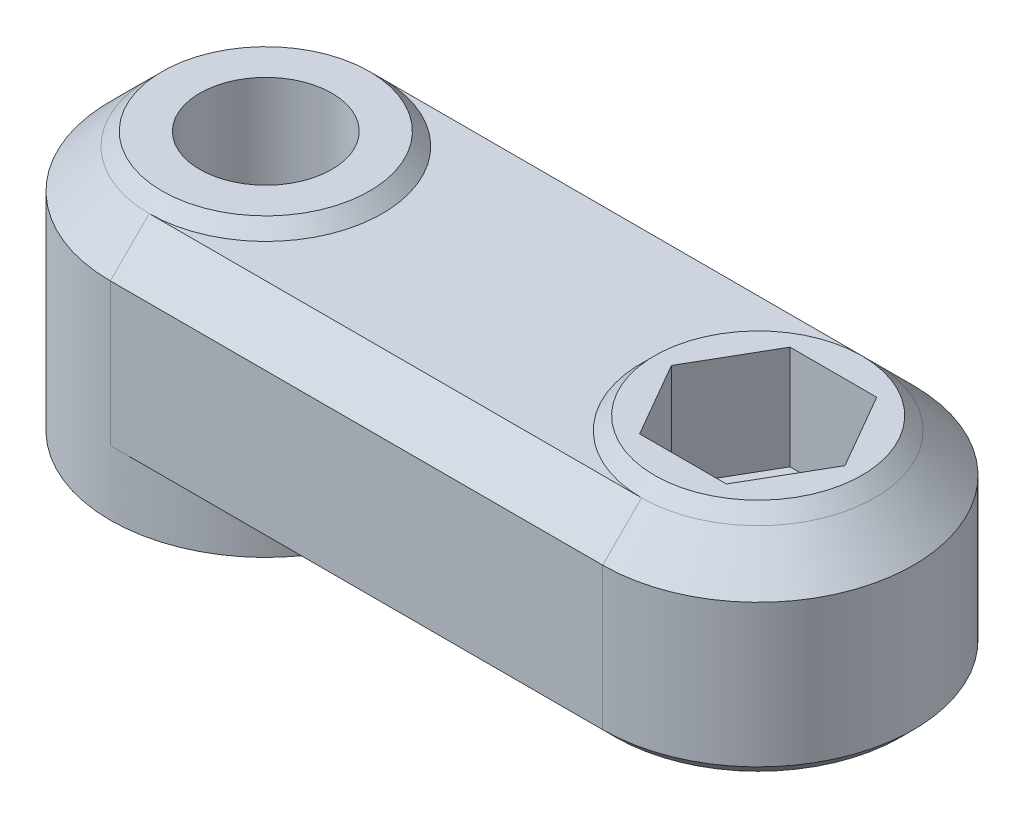
ISO-10303-21;
HEADER;
FILE_DESCRIPTION(('STEP AP214'),'2;1');
FILE_NAME('part.step','',(''),(''),'','','');
FILE_SCHEMA(('AUTOMOTIVE_DESIGN { 1 0 10303 214 1 1 1 1 }'));
ENDSEC;
DATA;
#1=APPLICATION_CONTEXT('core data for automotive mechanical design processes');
#2=APPLICATION_PROTOCOL_DEFINITION('international standard','automotive_design',2000,#1);
#3=PRODUCT_CONTEXT('',#1,'mechanical');
#4=PRODUCT('Part','Part','',(#3));
#5=PRODUCT_RELATED_PRODUCT_CATEGORY('part','',(#4));
#6=PRODUCT_DEFINITION_FORMATION('','',#4);
#7=PRODUCT_DEFINITION_CONTEXT('part definition',#1,'design');
#8=PRODUCT_DEFINITION('design','',#6,#7);
#9=PRODUCT_DEFINITION_SHAPE('','',#8);
#10=(LENGTH_UNIT() NAMED_UNIT(*) SI_UNIT(.MILLI.,.METRE.));
#11=(NAMED_UNIT(*) PLANE_ANGLE_UNIT() SI_UNIT($,.RADIAN.));
#12=(NAMED_UNIT(*) SI_UNIT($,.STERADIAN.) SOLID_ANGLE_UNIT());
#13=UNCERTAINTY_MEASURE_WITH_UNIT(LENGTH_MEASURE(1.E-05),#10,'distance_accuracy_value','');
#14=(GEOMETRIC_REPRESENTATION_CONTEXT(3) GLOBAL_UNCERTAINTY_ASSIGNED_CONTEXT((#13)) GLOBAL_UNIT_ASSIGNED_CONTEXT((#10,
#11,#12)) REPRESENTATION_CONTEXT('',''));
#15=CARTESIAN_POINT('',(0.,0.,0.));
#16=DIRECTION('',(0.,0.,1.));
#17=DIRECTION('',(1.,0.,0.));
#18=AXIS2_PLACEMENT_3D('',#15,#16,#17);
#19=CARTESIAN_POINT('',(0.,10.,0.));
#20=DIRECTION('',(0.,1.,0.));
#21=DIRECTION('',(0.,0.,1.));
#22=AXIS2_PLACEMENT_3D('',#19,#20,#21);
#23=PLANE('',#22);
#24=DIRECTION('',(1.,0.,0.));
#25=VECTOR('',#24,1.);
#26=CARTESIAN_POINT('',(17.3256842193501,10.,2.89999999999999));
#27=LINE('',#26,#25);
#28=CARTESIAN_POINT('',(17.3256842193501,10.,2.89999999999999));
#29=VERTEX_POINT('',#28);
#30=CARTESIAN_POINT('',(20.6743157806499,10.,2.89999999999999));
#31=VERTEX_POINT('',#30);
#32=EDGE_CURVE('E205',#29,#31,#27,.T.);
#33=ORIENTED_EDGE('',*,*,#32,.F.);
#34=DIRECTION('',(0.5,0.,0.866025403784439));
#35=VECTOR('',#34,1.);
#36=CARTESIAN_POINT('',(15.6513684387002,10.,0.));
#37=LINE('',#36,#35);
#38=CARTESIAN_POINT('',(15.6513684387002,10.,0.));
#39=VERTEX_POINT('',#38);
#40=EDGE_CURVE('E332',#39,#29,#37,.T.);
#41=ORIENTED_EDGE('',*,*,#40,.F.);
#42=DIRECTION('',(-0.5,0.,0.866025403784439));
#43=VECTOR('',#42,1.);
#44=CARTESIAN_POINT('',(17.3256842193501,10.,-2.9));
#45=LINE('',#44,#43);
#46=CARTESIAN_POINT('',(17.3256842193501,10.,-2.9));
#47=VERTEX_POINT('',#46);
#48=EDGE_CURVE('E336',#47,#39,#45,.T.);
#49=ORIENTED_EDGE('',*,*,#48,.F.);
#50=DIRECTION('',(-1.,0.,0.));
#51=VECTOR('',#50,1.);
#52=CARTESIAN_POINT('',(20.6743157806499,10.,-2.9));
#53=LINE('',#52,#51);
#54=CARTESIAN_POINT('',(20.6743157806499,10.,-2.9));
#55=VERTEX_POINT('',#54);
#56=EDGE_CURVE('E339',#55,#47,#53,.T.);
#57=ORIENTED_EDGE('',*,*,#56,.F.);
#58=DIRECTION('',(-0.5,0.,-0.866025403784439));
#59=VECTOR('',#58,1.);
#60=CARTESIAN_POINT('',(22.3486315612998,10.,0.));
#61=LINE('',#60,#59);
#62=CARTESIAN_POINT('',(22.3486315612998,10.,0.));
#63=VERTEX_POINT('',#62);
#64=EDGE_CURVE('E342',#63,#55,#61,.T.);
#65=ORIENTED_EDGE('',*,*,#64,.F.);
#66=DIRECTION('',(0.5,0.,-0.866025403784438));
#67=VECTOR('',#66,1.);
#68=CARTESIAN_POINT('',(20.6743157806499,10.,2.89999999999999));
#69=LINE('',#68,#67);
#70=EDGE_CURVE('E345',#31,#63,#69,.T.);
#71=ORIENTED_EDGE('',*,*,#70,.F.);
#72=EDGE_LOOP('',(#33,#41,#49,#57,#65,#71));
#73=FACE_BOUND('',#72,.T.);
#74=CARTESIAN_POINT('',(19.,10.,0.));
#75=DIRECTION('',(0.,1.,0.));
#76=DIRECTION('',(0.,0.,1.));
#77=AXIS2_PLACEMENT_3D('',#74,#75,#76);
#78=CIRCLE('',#77,4.);
#79=CARTESIAN_POINT('',(19.,10.,4.));
#80=VERTEX_POINT('',#79);
#81=EDGE_CURVE('E243',#80,#80,#78,.T.);
#82=ORIENTED_EDGE('',*,*,#81,.T.);
#83=EDGE_LOOP('',(#82));
#84=FACE_BOUND('',#83,.T.);
#85=ADVANCED_FACE('F35',(#73,#84),#23,.T.);
#86=CARTESIAN_POINT('',(0.,10.,0.));
#87=DIRECTION('',(0.,-1.,0.));
#88=DIRECTION('',(0.,0.,-1.));
#89=AXIS2_PLACEMENT_3D('',#86,#87,#88);
#90=CIRCLE('',#89,2.55);
#91=CARTESIAN_POINT('',(0.,10.,-2.55));
#92=VERTEX_POINT('',#91);
#93=EDGE_CURVE('E262',#92,#92,#90,.T.);
#94=ORIENTED_EDGE('',*,*,#93,.T.);
#95=EDGE_LOOP('',(#94));
#96=FACE_BOUND('',#95,.T.);
#97=CARTESIAN_POINT('',(0.,10.,0.));
#98=DIRECTION('',(0.,1.,0.));
#99=DIRECTION('',(0.,0.,1.));
#100=AXIS2_PLACEMENT_3D('',#97,#98,#99);
#101=CIRCLE('',#100,4.);
#102=CARTESIAN_POINT('',(0.,10.,4.));
#103=VERTEX_POINT('',#102);
#104=EDGE_CURVE('E246',#103,#103,#101,.T.);
#105=ORIENTED_EDGE('',*,*,#104,.T.);
#106=EDGE_LOOP('',(#105));
#107=FACE_BOUND('',#106,.T.);
#108=ADVANCED_FACE('F416',(#96,#107),#23,.T.);
#109=CARTESIAN_POINT('',(0.,10.,6.));
#110=DIRECTION('',(0.,0.,-1.));
#111=DIRECTION('',(-1.,0.,0.));
#112=AXIS2_PLACEMENT_3D('',#109,#110,#111);
#113=PLANE('',#112);
#114=DIRECTION('',(0.,-1.,0.));
#115=VECTOR('',#114,1.);
#116=CARTESIAN_POINT('',(0.,10.,6.));
#117=LINE('',#116,#115);
#118=CARTESIAN_POINT('',(0.,7.99999999999999,6.));
#119=VERTEX_POINT('',#118);
#120=CARTESIAN_POINT('',(0.,2.5,6.));
#121=VERTEX_POINT('',#120);
#122=EDGE_CURVE('E249',#119,#121,#117,.T.);
#123=ORIENTED_EDGE('',*,*,#122,.T.);
#124=DIRECTION('',(1.,0.,0.));
#125=VECTOR('',#124,1.);
#126=CARTESIAN_POINT('',(19.,2.5,6.));
#127=LINE('',#126,#125);
#128=CARTESIAN_POINT('',(19.,2.5,6.));
#129=VERTEX_POINT('',#128);
#130=EDGE_CURVE('E216',#121,#129,#127,.T.);
#131=ORIENTED_EDGE('',*,*,#130,.T.);
#132=DIRECTION('',(0.,-1.,0.));
#133=VECTOR('',#132,1.);
#134=CARTESIAN_POINT('',(19.,10.,6.));
#135=LINE('',#134,#133);
#136=CARTESIAN_POINT('',(19.,7.99999999999999,6.));
#137=VERTEX_POINT('',#136);
#138=EDGE_CURVE('E252',#137,#129,#135,.T.);
#139=ORIENTED_EDGE('',*,*,#138,.F.);
#140=DIRECTION('',(-1.,0.,0.));
#141=VECTOR('',#140,1.);
#142=CARTESIAN_POINT('',(0.,7.99999999999999,6.));
#143=LINE('',#142,#141);
#144=EDGE_CURVE('E196',#137,#119,#143,.T.);
#145=ORIENTED_EDGE('',*,*,#144,.T.);
#146=EDGE_LOOP('',(#123,#131,#139,#145));
#147=FACE_BOUND('',#146,.T.);
#148=ADVANCED_FACE('F423',(#147),#113,.F.);
#149=CARTESIAN_POINT('',(19.,10.,0.));
#150=DIRECTION('',(0.,-1.,0.));
#151=DIRECTION('',(0.,0.,-1.));
#152=AXIS2_PLACEMENT_3D('',#149,#150,#151);
#153=CYLINDRICAL_SURFACE('',#152,6.);
#154=ORIENTED_EDGE('',*,*,#138,.T.);
#155=CARTESIAN_POINT('',(19.,2.5,0.));
#156=DIRECTION('',(0.,-1.,0.));
#157=DIRECTION('',(0.,0.,-1.));
#158=AXIS2_PLACEMENT_3D('',#155,#156,#157);
#159=CIRCLE('',#158,6.);
#160=CARTESIAN_POINT('',(19.,2.5,-6.));
#161=VERTEX_POINT('',#160);
#162=EDGE_CURVE('E214',#129,#161,#159,.F.);
#163=ORIENTED_EDGE('',*,*,#162,.T.);
#164=DIRECTION('',(0.,-1.,0.));
#165=VECTOR('',#164,1.);
#166=CARTESIAN_POINT('',(19.,10.,-6.));
#167=LINE('',#166,#165);
#168=CARTESIAN_POINT('',(19.,7.99999999999999,-6.));
#169=VERTEX_POINT('',#168);
#170=EDGE_CURVE('E255',#169,#161,#167,.T.);
#171=ORIENTED_EDGE('',*,*,#170,.F.);
#172=CARTESIAN_POINT('',(19.,7.99999999999999,0.));
#173=DIRECTION('',(0.,1.,0.));
#174=DIRECTION('',(0.,0.,1.));
#175=AXIS2_PLACEMENT_3D('',#172,#173,#174);
#176=CIRCLE('',#175,6.);
#177=EDGE_CURVE('E240',#169,#137,#176,.F.);
#178=ORIENTED_EDGE('',*,*,#177,.T.);
#179=EDGE_LOOP('',(#154,#163,#171,#178));
#180=FACE_BOUND('',#179,.T.);
#181=ADVANCED_FACE('F381',(#180),#153,.T.);
#182=CARTESIAN_POINT('',(0.,10.,-6.));
#183=DIRECTION('',(0.,0.,1.));
#184=DIRECTION('',(1.,0.,0.));
#185=AXIS2_PLACEMENT_3D('',#182,#183,#184);
#186=PLANE('',#185);
#187=ORIENTED_EDGE('',*,*,#170,.T.);
#188=DIRECTION('',(-1.,0.,0.));
#189=VECTOR('',#188,1.);
#190=CARTESIAN_POINT('',(0.,2.5,-6.));
#191=LINE('',#190,#189);
#192=CARTESIAN_POINT('',(0.,2.5,-6.));
#193=VERTEX_POINT('',#192);
#194=EDGE_CURVE('E57',#161,#193,#191,.T.);
#195=ORIENTED_EDGE('',*,*,#194,.T.);
#196=DIRECTION('',(0.,-1.,0.));
#197=VECTOR('',#196,1.);
#198=CARTESIAN_POINT('',(0.,10.,-6.));
#199=LINE('',#198,#197);
#200=CARTESIAN_POINT('',(0.,7.99999999999999,-6.));
#201=VERTEX_POINT('',#200);
#202=EDGE_CURVE('E257',#201,#193,#199,.T.);
#203=ORIENTED_EDGE('',*,*,#202,.F.);
#204=DIRECTION('',(1.,0.,0.));
#205=VECTOR('',#204,1.);
#206=CARTESIAN_POINT('',(19.,7.99999999999999,-6.));
#207=LINE('',#206,#205);
#208=EDGE_CURVE('E225',#201,#169,#207,.T.);
#209=ORIENTED_EDGE('',*,*,#208,.T.);
#210=EDGE_LOOP('',(#187,#195,#203,#209));
#211=FACE_BOUND('',#210,.T.);
#212=ADVANCED_FACE('F379',(#211),#186,.F.);
#213=CARTESIAN_POINT('',(0.,0.,0.));
#214=DIRECTION('',(0.,1.,0.));
#215=DIRECTION('',(0.,0.,1.));
#216=AXIS2_PLACEMENT_3D('',#213,#214,#215);
#217=PLANE('',#216);
#218=DIRECTION('',(-1.,0.,0.));
#219=VECTOR('',#218,1.);
#220=CARTESIAN_POINT('',(2.10732848254213,0.,3.65));
#221=LINE('',#220,#219);
#222=CARTESIAN_POINT('',(2.10732848254213,0.,3.65));
#223=VERTEX_POINT('',#222);
#224=CARTESIAN_POINT('',(-2.10732848254216,0.,3.64999999999998));
#225=VERTEX_POINT('',#224);
#226=EDGE_CURVE('E296',#223,#225,#221,.T.);
#227=ORIENTED_EDGE('',*,*,#226,.F.);
#228=DIRECTION('',(-0.500000000000007,0.,0.866025403784434));
#229=VECTOR('',#228,1.);
#230=CARTESIAN_POINT('',(4.21465696508428,0.,0.));
#231=LINE('',#230,#229);
#232=CARTESIAN_POINT('',(4.21465696508428,0.,0.));
#233=VERTEX_POINT('',#232);
#234=EDGE_CURVE('E229',#233,#223,#231,.T.);
#235=ORIENTED_EDGE('',*,*,#234,.F.);
#236=DIRECTION('',(0.499999999999989,0.,0.866025403784445));
#237=VECTOR('',#236,1.);
#238=CARTESIAN_POINT('',(2.10732848254218,0.,-3.65));
#239=LINE('',#238,#237);
#240=CARTESIAN_POINT('',(2.10732848254218,0.,-3.65));
#241=VERTEX_POINT('',#240);
#242=EDGE_CURVE('E283',#241,#233,#239,.T.);
#243=ORIENTED_EDGE('',*,*,#242,.F.);
#244=DIRECTION('',(1.,0.,0.));
#245=VECTOR('',#244,1.);
#246=CARTESIAN_POINT('',(-2.1073284825421,0.,-3.65000000000005));
#247=LINE('',#246,#245);
#248=CARTESIAN_POINT('',(-2.1073284825421,0.,-3.65000000000005));
#249=VERTEX_POINT('',#248);
#250=EDGE_CURVE('E287',#249,#241,#247,.T.);
#251=ORIENTED_EDGE('',*,*,#250,.F.);
#252=DIRECTION('',(0.500000000000007,0.,-0.866025403784434));
#253=VECTOR('',#252,1.);
#254=CARTESIAN_POINT('',(-4.21465696508428,0.,0.));
#255=LINE('',#254,#253);
#256=CARTESIAN_POINT('',(-4.21465696508428,0.,0.));
#257=VERTEX_POINT('',#256);
#258=EDGE_CURVE('E290',#257,#249,#255,.T.);
#259=ORIENTED_EDGE('',*,*,#258,.F.);
#260=DIRECTION('',(-0.499999999999995,0.,-0.866025403784442));
#261=VECTOR('',#260,1.);
#262=CARTESIAN_POINT('',(-2.10732848254216,0.,3.64999999999998));
#263=LINE('',#262,#261);
#264=EDGE_CURVE('E293',#225,#257,#263,.T.);
#265=ORIENTED_EDGE('',*,*,#264,.F.);
#266=EDGE_LOOP('',(#227,#235,#243,#251,#259,#265));
#267=FACE_BOUND('',#266,.T.);
#268=CARTESIAN_POINT('',(0.,0.,0.));
#269=DIRECTION('',(0.,1.,0.));
#270=DIRECTION('',(0.,0.,1.));
#271=AXIS2_PLACEMENT_3D('',#268,#269,#270);
#272=CIRCLE('',#271,6.);
#273=CARTESIAN_POINT('',(0.,0.,6.));
#274=VERTEX_POINT('',#273);
#275=EDGE_CURVE('E259',#274,#274,#272,.T.);
#276=ORIENTED_EDGE('',*,*,#275,.F.);
#277=EDGE_LOOP('',(#276));
#278=FACE_BOUND('',#277,.T.);
#279=ADVANCED_FACE('F431',(#267,#278),#217,.F.);
#280=CARTESIAN_POINT('',(19.,0.,0.));
#281=DIRECTION('',(0.,-1.,0.));
#282=DIRECTION('',(0.,0.,-1.));
#283=AXIS2_PLACEMENT_3D('',#280,#281,#282);
#284=CYLINDRICAL_SURFACE('',#283,2.075);
#285=CARTESIAN_POINT('',(19.,6.,0.));
#286=DIRECTION('',(0.,-1.,0.));
#287=DIRECTION('',(0.,0.,-1.));
#288=AXIS2_PLACEMENT_3D('',#285,#286,#287);
#289=CIRCLE('',#288,2.075);
#290=CARTESIAN_POINT('',(19.,6.,-2.075));
#291=VERTEX_POINT('',#290);
#292=EDGE_CURVE('E233',#291,#291,#289,.T.);
#293=ORIENTED_EDGE('',*,*,#292,.F.);
#294=EDGE_LOOP('',(#293));
#295=FACE_BOUND('',#294,.T.);
#296=CARTESIAN_POINT('',(19.,2.,0.));
#297=DIRECTION('',(0.,-1.,0.));
#298=DIRECTION('',(0.,0.,-1.));
#299=AXIS2_PLACEMENT_3D('',#296,#297,#298);
#300=CIRCLE('',#299,2.075);
#301=CARTESIAN_POINT('',(19.,2.,-2.075));
#302=VERTEX_POINT('',#301);
#303=EDGE_CURVE('E226',#302,#302,#300,.T.);
#304=ORIENTED_EDGE('',*,*,#303,.T.);
#305=EDGE_LOOP('',(#304));
#306=FACE_BOUND('',#305,.T.);
#307=ADVANCED_FACE('F434',(#295,#306),#284,.F.);
#308=CARTESIAN_POINT('',(0.,10.,0.));
#309=DIRECTION('',(0.,-1.,0.));
#310=DIRECTION('',(0.,0.,-1.));
#311=AXIS2_PLACEMENT_3D('',#308,#309,#310);
#312=CYLINDRICAL_SURFACE('',#311,6.);
#313=ORIENTED_EDGE('',*,*,#275,.T.);
#314=EDGE_LOOP('',(#313));
#315=FACE_BOUND('',#314,.T.);
#316=ORIENTED_EDGE('',*,*,#202,.T.);
#317=CARTESIAN_POINT('',(0.,-3.50000000000004,0.));
#318=DIRECTION('',(0.,-0.707106781186545,-0.70710678118655));
#319=DIRECTION('',(0.,-0.70710678118655,0.707106781186545));
#320=AXIS2_PLACEMENT_3D('',#317,#318,#319);
#321=ELLIPSE('',#320,8.4852813742386,6.);
#322=CARTESIAN_POINT('',(2.39791576165636,2.,-5.5));
#323=VERTEX_POINT('',#322);
#324=EDGE_CURVE('E179',#193,#323,#321,.T.);
#325=ORIENTED_EDGE('',*,*,#324,.T.);
#326=CARTESIAN_POINT('',(0.,2.,0.));
#327=DIRECTION('',(0.,-1.,0.));
#328=DIRECTION('',(0.,0.,-1.));
#329=AXIS2_PLACEMENT_3D('',#326,#327,#328);
#330=CIRCLE('',#329,6.);
#331=CARTESIAN_POINT('',(2.39791576165636,2.,5.5));
#332=VERTEX_POINT('',#331);
#333=EDGE_CURVE('E230',#323,#332,#330,.T.);
#334=ORIENTED_EDGE('',*,*,#333,.T.);
#335=CARTESIAN_POINT('',(0.,-3.50000000000004,0.));
#336=DIRECTION('',(0.,-0.707106781186545,0.70710678118655));
#337=DIRECTION('',(0.,-0.70710678118655,-0.707106781186545));
#338=AXIS2_PLACEMENT_3D('',#335,#336,#337);
#339=ELLIPSE('',#338,8.4852813742386,6.);
#340=EDGE_CURVE('E211',#332,#121,#339,.T.);
#341=ORIENTED_EDGE('',*,*,#340,.T.);
#342=ORIENTED_EDGE('',*,*,#122,.F.);
#343=CARTESIAN_POINT('',(0.,7.99999999999999,0.));
#344=DIRECTION('',(0.,1.,0.));
#345=DIRECTION('',(0.,0.,1.));
#346=AXIS2_PLACEMENT_3D('',#343,#344,#345);
#347=CIRCLE('',#346,6.);
#348=EDGE_CURVE('E237',#119,#201,#347,.F.);
#349=ORIENTED_EDGE('',*,*,#348,.T.);
#350=EDGE_LOOP('',(#316,#325,#334,#341,#342,#349));
#351=FACE_BOUND('',#350,.T.);
#352=ADVANCED_FACE('F398',(#315,#351),#312,.T.);
#353=CARTESIAN_POINT('',(0.,0.,0.));
#354=DIRECTION('',(0.,-1.,0.));
#355=DIRECTION('',(0.,0.,-1.));
#356=AXIS2_PLACEMENT_3D('',#353,#354,#355);
#357=CYLINDRICAL_SURFACE('',#356,2.55);
#358=CARTESIAN_POINT('',(0.,5.,0.));
#359=DIRECTION('',(0.,-1.,0.));
#360=DIRECTION('',(0.,0.,-1.));
#361=AXIS2_PLACEMENT_3D('',#358,#359,#360);
#362=CIRCLE('',#361,2.55);
#363=CARTESIAN_POINT('',(0.,5.,-2.55));
#364=VERTEX_POINT('',#363);
#365=EDGE_CURVE('E198',#364,#364,#362,.T.);
#366=ORIENTED_EDGE('',*,*,#365,.T.);
#367=EDGE_LOOP('',(#366));
#368=FACE_BOUND('',#367,.T.);
#369=ORIENTED_EDGE('',*,*,#93,.F.);
#370=EDGE_LOOP('',(#369));
#371=FACE_BOUND('',#370,.T.);
#372=ADVANCED_FACE('F429',(#368,#371),#357,.F.);
#373=CARTESIAN_POINT('',(16.5,6.,0.));
#374=DIRECTION('',(0.,1.,0.));
#375=DIRECTION('',(0.,0.,1.));
#376=AXIS2_PLACEMENT_3D('',#373,#374,#375);
#377=PLANE('',#376);
#378=ORIENTED_EDGE('',*,*,#292,.T.);
#379=EDGE_LOOP('',(#378));
#380=FACE_BOUND('',#379,.T.);
#381=DIRECTION('',(1.,0.,0.));
#382=VECTOR('',#381,1.);
#383=CARTESIAN_POINT('',(17.3256842193501,6.,2.89999999999999));
#384=LINE('',#383,#382);
#385=CARTESIAN_POINT('',(17.3256842193501,6.,2.89999999999999));
#386=VERTEX_POINT('',#385);
#387=CARTESIAN_POINT('',(20.6743157806499,6.,2.89999999999999));
#388=VERTEX_POINT('',#387);
#389=EDGE_CURVE('E335',#386,#388,#384,.T.);
#390=ORIENTED_EDGE('',*,*,#389,.T.);
#391=DIRECTION('',(0.5,0.,-0.866025403784438));
#392=VECTOR('',#391,1.);
#393=CARTESIAN_POINT('',(20.6743157806499,6.,2.89999999999999));
#394=LINE('',#393,#392);
#395=CARTESIAN_POINT('',(22.3486315612998,6.,0.));
#396=VERTEX_POINT('',#395);
#397=EDGE_CURVE('E360',#388,#396,#394,.T.);
#398=ORIENTED_EDGE('',*,*,#397,.T.);
#399=DIRECTION('',(-0.5,0.,-0.866025403784439));
#400=VECTOR('',#399,1.);
#401=CARTESIAN_POINT('',(22.3486315612998,6.,0.));
#402=LINE('',#401,#400);
#403=CARTESIAN_POINT('',(20.6743157806499,6.,-2.9));
#404=VERTEX_POINT('',#403);
#405=EDGE_CURVE('E357',#396,#404,#402,.T.);
#406=ORIENTED_EDGE('',*,*,#405,.T.);
#407=DIRECTION('',(-1.,0.,0.));
#408=VECTOR('',#407,1.);
#409=CARTESIAN_POINT('',(20.6743157806499,6.,-2.9));
#410=LINE('',#409,#408);
#411=CARTESIAN_POINT('',(17.3256842193501,6.,-2.9));
#412=VERTEX_POINT('',#411);
#413=EDGE_CURVE('E354',#404,#412,#410,.T.);
#414=ORIENTED_EDGE('',*,*,#413,.T.);
#415=DIRECTION('',(-0.5,0.,0.866025403784439));
#416=VECTOR('',#415,1.);
#417=CARTESIAN_POINT('',(17.3256842193501,6.,-2.9));
#418=LINE('',#417,#416);
#419=CARTESIAN_POINT('',(15.6513684387002,6.,0.));
#420=VERTEX_POINT('',#419);
#421=EDGE_CURVE('E351',#412,#420,#418,.T.);
#422=ORIENTED_EDGE('',*,*,#421,.T.);
#423=DIRECTION('',(0.5,0.,0.866025403784439));
#424=VECTOR('',#423,1.);
#425=CARTESIAN_POINT('',(15.6513684387002,6.,0.));
#426=LINE('',#425,#424);
#427=EDGE_CURVE('E323',#420,#386,#426,.T.);
#428=ORIENTED_EDGE('',*,*,#427,.T.);
#429=EDGE_LOOP('',(#390,#398,#406,#414,#422,#428));
#430=FACE_BOUND('',#429,.T.);
#431=ADVANCED_FACE('F467',(#380,#430),#377,.T.);
#432=CARTESIAN_POINT('',(0.,10.,-4.));
#433=DIRECTION('',(0.,0.707106781186547,-0.707106781186548));
#434=DIRECTION('',(1.,0.,0.));
#435=AXIS2_PLACEMENT_3D('',#432,#433,#434);
#436=PLANE('',#435);
#437=DIRECTION('',(-1.,0.,0.));
#438=VECTOR('',#437,1.);
#439=CARTESIAN_POINT('',(0.,9.5,-4.5));
#440=LINE('',#439,#438);
#441=CARTESIAN_POINT('',(19.,9.5,-4.5));
#442=VERTEX_POINT('',#441);
#443=CARTESIAN_POINT('',(0.,9.5,-4.5));
#444=VERTEX_POINT('',#443);
#445=EDGE_CURVE('E209',#442,#444,#440,.T.);
#446=ORIENTED_EDGE('',*,*,#445,.F.);
#447=DIRECTION('',(0.,0.707106781186548,0.707106781186547));
#448=VECTOR('',#447,1.);
#449=CARTESIAN_POINT('',(19.,7.99999999999999,-6.));
#450=LINE('',#449,#448);
#451=EDGE_CURVE('E189',#169,#442,#450,.T.);
#452=ORIENTED_EDGE('',*,*,#451,.F.);
#453=ORIENTED_EDGE('',*,*,#208,.F.);
#454=DIRECTION('',(0.,-0.707106781186548,-0.707106781186547));
#455=VECTOR('',#454,1.);
#456=CARTESIAN_POINT('',(0.,10.,-4.));
#457=LINE('',#456,#455);
#458=EDGE_CURVE('E231',#444,#201,#457,.T.);
#459=ORIENTED_EDGE('',*,*,#458,.F.);
#460=EDGE_LOOP('',(#446,#452,#453,#459));
#461=FACE_BOUND('',#460,.T.);
#462=ADVANCED_FACE('F377',(#461),#436,.T.);
#463=CARTESIAN_POINT('',(0.,10.,0.));
#464=DIRECTION('',(0.,-1.,0.));
#465=DIRECTION('',(0.,0.,-1.));
#466=AXIS2_PLACEMENT_3D('',#463,#464,#465);
#467=CONICAL_SURFACE('',#466,4.,0.785398163397447);
#468=CARTESIAN_POINT('',(0.,9.5,0.));
#469=DIRECTION('',(0.,-1.,0.));
#470=DIRECTION('',(0.,0.,-1.));
#471=AXIS2_PLACEMENT_3D('',#468,#469,#470);
#472=CIRCLE('',#471,4.5);
#473=CARTESIAN_POINT('',(0.,9.5,4.5));
#474=VERTEX_POINT('',#473);
#475=EDGE_CURVE('E191',#444,#474,#472,.F.);
#476=ORIENTED_EDGE('',*,*,#475,.F.);
#477=ORIENTED_EDGE('',*,*,#458,.T.);
#478=ORIENTED_EDGE('',*,*,#348,.F.);
#479=DIRECTION('',(0.,-0.707106781186548,0.707106781186547));
#480=VECTOR('',#479,1.);
#481=CARTESIAN_POINT('',(0.,10.,4.));
#482=LINE('',#481,#480);
#483=EDGE_CURVE('E197',#474,#119,#482,.T.);
#484=ORIENTED_EDGE('',*,*,#483,.F.);
#485=EDGE_LOOP('',(#476,#477,#478,#484));
#486=FACE_BOUND('',#485,.T.);
#487=ADVANCED_FACE('F373',(#486),#467,.T.);
#488=CARTESIAN_POINT('',(19.,10.,0.));
#489=DIRECTION('',(0.,-1.,0.));
#490=DIRECTION('',(0.,0.,-1.));
#491=AXIS2_PLACEMENT_3D('',#488,#489,#490);
#492=CONICAL_SURFACE('',#491,4.,0.785398163397447);
#493=CARTESIAN_POINT('',(19.,9.5,0.));
#494=DIRECTION('',(0.,-1.,0.));
#495=DIRECTION('',(0.,0.,-1.));
#496=AXIS2_PLACEMENT_3D('',#493,#494,#495);
#497=CIRCLE('',#496,4.5);
#498=CARTESIAN_POINT('',(19.,9.5,4.5));
#499=VERTEX_POINT('',#498);
#500=EDGE_CURVE('E184',#499,#442,#497,.F.);
#501=ORIENTED_EDGE('',*,*,#500,.F.);
#502=DIRECTION('',(0.,0.707106781186548,-0.707106781186547));
#503=VECTOR('',#502,1.);
#504=CARTESIAN_POINT('',(19.,7.99999999999999,6.));
#505=LINE('',#504,#503);
#506=EDGE_CURVE('E187',#137,#499,#505,.T.);
#507=ORIENTED_EDGE('',*,*,#506,.F.);
#508=ORIENTED_EDGE('',*,*,#177,.F.);
#509=ORIENTED_EDGE('',*,*,#451,.T.);
#510=EDGE_LOOP('',(#501,#507,#508,#509));
#511=FACE_BOUND('',#510,.T.);
#512=ADVANCED_FACE('F185',(#511),#492,.T.);
#513=CARTESIAN_POINT('',(0.,10.,4.));
#514=DIRECTION('',(0.,0.707106781186547,0.707106781186548));
#515=DIRECTION('',(-1.,0.,0.));
#516=AXIS2_PLACEMENT_3D('',#513,#514,#515);
#517=PLANE('',#516);
#518=DIRECTION('',(1.,0.,0.));
#519=VECTOR('',#518,1.);
#520=CARTESIAN_POINT('',(0.,9.5,4.5));
#521=LINE('',#520,#519);
#522=EDGE_CURVE('E171',#474,#499,#521,.T.);
#523=ORIENTED_EDGE('',*,*,#522,.F.);
#524=ORIENTED_EDGE('',*,*,#483,.T.);
#525=ORIENTED_EDGE('',*,*,#144,.F.);
#526=ORIENTED_EDGE('',*,*,#506,.T.);
#527=EDGE_LOOP('',(#523,#524,#525,#526));
#528=FACE_BOUND('',#527,.T.);
#529=ADVANCED_FACE('F194',(#528),#517,.T.);
#530=CARTESIAN_POINT('',(4.21465696508428,5.,0.));
#531=DIRECTION('',(0.866025403784434,0.,0.500000000000007));
#532=DIRECTION('',(0.500000000000007,0.,-0.866025403784434));
#533=AXIS2_PLACEMENT_3D('',#530,#531,#532);
#534=PLANE('',#533);
#535=ORIENTED_EDGE('',*,*,#234,.T.);
#536=DIRECTION('',(0.,-1.,0.));
#537=VECTOR('',#536,1.);
#538=CARTESIAN_POINT('',(2.10732848254213,5.,3.65));
#539=LINE('',#538,#537);
#540=CARTESIAN_POINT('',(2.10732848254213,5.,3.65));
#541=VERTEX_POINT('',#540);
#542=EDGE_CURVE('E270',#541,#223,#539,.T.);
#543=ORIENTED_EDGE('',*,*,#542,.F.);
#544=DIRECTION('',(-0.500000000000007,0.,0.866025403784434));
#545=VECTOR('',#544,1.);
#546=CARTESIAN_POINT('',(4.21465696508428,5.,0.));
#547=LINE('',#546,#545);
#548=CARTESIAN_POINT('',(4.21465696508428,5.,0.));
#549=VERTEX_POINT('',#548);
#550=EDGE_CURVE('E286',#549,#541,#547,.T.);
#551=ORIENTED_EDGE('',*,*,#550,.F.);
#552=DIRECTION('',(0.,-1.,0.));
#553=VECTOR('',#552,1.);
#554=CARTESIAN_POINT('',(4.21465696508428,5.,0.));
#555=LINE('',#554,#553);
#556=EDGE_CURVE('E269',#549,#233,#555,.T.);
#557=ORIENTED_EDGE('',*,*,#556,.T.);
#558=EDGE_LOOP('',(#535,#543,#551,#557));
#559=FACE_BOUND('',#558,.T.);
#560=ADVANCED_FACE('F452',(#559),#534,.F.);
#561=CARTESIAN_POINT('',(2.10732848254218,5.,-3.65));
#562=DIRECTION('',(0.866025403784445,0.,-0.499999999999989));
#563=DIRECTION('',(-0.499999999999989,0.,-0.866025403784445));
#564=AXIS2_PLACEMENT_3D('',#561,#562,#563);
#565=PLANE('',#564);
#566=ORIENTED_EDGE('',*,*,#242,.T.);
#567=ORIENTED_EDGE('',*,*,#556,.F.);
#568=DIRECTION('',(0.499999999999989,0.,0.866025403784445));
#569=VECTOR('',#568,1.);
#570=CARTESIAN_POINT('',(2.10732848254218,5.,-3.65));
#571=LINE('',#570,#569);
#572=CARTESIAN_POINT('',(2.10732848254218,5.,-3.65));
#573=VERTEX_POINT('',#572);
#574=EDGE_CURVE('E274',#573,#549,#571,.T.);
#575=ORIENTED_EDGE('',*,*,#574,.F.);
#576=DIRECTION('',(0.,-1.,0.));
#577=VECTOR('',#576,1.);
#578=CARTESIAN_POINT('',(2.10732848254218,5.,-3.65));
#579=LINE('',#578,#577);
#580=EDGE_CURVE('E280',#573,#241,#579,.T.);
#581=ORIENTED_EDGE('',*,*,#580,.T.);
#582=EDGE_LOOP('',(#566,#567,#575,#581));
#583=FACE_BOUND('',#582,.T.);
#584=ADVANCED_FACE('F514',(#583),#565,.F.);
#585=CARTESIAN_POINT('',(-2.1073284825421,5.,-3.65000000000005));
#586=DIRECTION('',(0.,0.,-1.));
#587=DIRECTION('',(-1.,0.,0.));
#588=AXIS2_PLACEMENT_3D('',#585,#586,#587);
#589=PLANE('',#588);
#590=ORIENTED_EDGE('',*,*,#250,.T.);
#591=ORIENTED_EDGE('',*,*,#580,.F.);
#592=DIRECTION('',(1.,0.,0.));
#593=VECTOR('',#592,1.);
#594=CARTESIAN_POINT('',(-2.1073284825421,5.,-3.65000000000005));
#595=LINE('',#594,#593);
#596=CARTESIAN_POINT('',(-2.1073284825421,5.,-3.65000000000005));
#597=VERTEX_POINT('',#596);
#598=EDGE_CURVE('E302',#597,#573,#595,.T.);
#599=ORIENTED_EDGE('',*,*,#598,.F.);
#600=DIRECTION('',(0.,-1.,0.));
#601=VECTOR('',#600,1.);
#602=CARTESIAN_POINT('',(-2.1073284825421,5.,-3.65000000000005));
#603=LINE('',#602,#601);
#604=EDGE_CURVE('E278',#597,#249,#603,.T.);
#605=ORIENTED_EDGE('',*,*,#604,.T.);
#606=EDGE_LOOP('',(#590,#591,#599,#605));
#607=FACE_BOUND('',#606,.T.);
#608=ADVANCED_FACE('F517',(#607),#589,.F.);
#609=CARTESIAN_POINT('',(-4.21465696508428,5.,0.));
#610=DIRECTION('',(-0.866025403784434,0.,-0.500000000000007));
#611=DIRECTION('',(-0.500000000000007,0.,0.866025403784434));
#612=AXIS2_PLACEMENT_3D('',#609,#610,#611);
#613=PLANE('',#612);
#614=ORIENTED_EDGE('',*,*,#258,.T.);
#615=ORIENTED_EDGE('',*,*,#604,.F.);
#616=DIRECTION('',(0.500000000000007,0.,-0.866025403784434));
#617=VECTOR('',#616,1.);
#618=CARTESIAN_POINT('',(-4.21465696508428,5.,0.));
#619=LINE('',#618,#617);
#620=CARTESIAN_POINT('',(-4.21465696508428,5.,0.));
#621=VERTEX_POINT('',#620);
#622=EDGE_CURVE('E305',#621,#597,#619,.T.);
#623=ORIENTED_EDGE('',*,*,#622,.F.);
#624=DIRECTION('',(0.,-1.,0.));
#625=VECTOR('',#624,1.);
#626=CARTESIAN_POINT('',(-4.21465696508428,5.,0.));
#627=LINE('',#626,#625);
#628=EDGE_CURVE('E276',#621,#257,#627,.T.);
#629=ORIENTED_EDGE('',*,*,#628,.T.);
#630=EDGE_LOOP('',(#614,#615,#623,#629));
#631=FACE_BOUND('',#630,.T.);
#632=ADVANCED_FACE('F521',(#631),#613,.F.);
#633=CARTESIAN_POINT('',(-2.10732848254216,5.,3.64999999999998));
#634=DIRECTION('',(-0.866025403784442,0.,0.499999999999995));
#635=DIRECTION('',(0.499999999999995,0.,0.866025403784442));
#636=AXIS2_PLACEMENT_3D('',#633,#634,#635);
#637=PLANE('',#636);
#638=ORIENTED_EDGE('',*,*,#264,.T.);
#639=ORIENTED_EDGE('',*,*,#628,.F.);
#640=DIRECTION('',(-0.499999999999995,0.,-0.866025403784442));
#641=VECTOR('',#640,1.);
#642=CARTESIAN_POINT('',(-2.10732848254216,5.,3.64999999999998));
#643=LINE('',#642,#641);
#644=CARTESIAN_POINT('',(-2.10732848254216,5.,3.64999999999998));
#645=VERTEX_POINT('',#644);
#646=EDGE_CURVE('E308',#645,#621,#643,.T.);
#647=ORIENTED_EDGE('',*,*,#646,.F.);
#648=DIRECTION('',(0.,-1.,0.));
#649=VECTOR('',#648,1.);
#650=CARTESIAN_POINT('',(-2.10732848254216,5.,3.64999999999998));
#651=LINE('',#650,#649);
#652=EDGE_CURVE('E273',#645,#225,#651,.T.);
#653=ORIENTED_EDGE('',*,*,#652,.T.);
#654=EDGE_LOOP('',(#638,#639,#647,#653));
#655=FACE_BOUND('',#654,.T.);
#656=ADVANCED_FACE('F525',(#655),#637,.F.);
#657=CARTESIAN_POINT('',(2.10732848254213,5.,3.65));
#658=DIRECTION('',(0.,0.,1.));
#659=DIRECTION('',(1.,0.,0.));
#660=AXIS2_PLACEMENT_3D('',#657,#658,#659);
#661=PLANE('',#660);
#662=ORIENTED_EDGE('',*,*,#226,.T.);
#663=ORIENTED_EDGE('',*,*,#652,.F.);
#664=DIRECTION('',(-1.,0.,0.));
#665=VECTOR('',#664,1.);
#666=CARTESIAN_POINT('',(2.10732848254213,5.,3.65));
#667=LINE('',#666,#665);
#668=EDGE_CURVE('E311',#541,#645,#667,.T.);
#669=ORIENTED_EDGE('',*,*,#668,.F.);
#670=ORIENTED_EDGE('',*,*,#542,.T.);
#671=EDGE_LOOP('',(#662,#663,#669,#670));
#672=FACE_BOUND('',#671,.T.);
#673=ADVANCED_FACE('F512',(#672),#661,.F.);
#674=CARTESIAN_POINT('',(0.,5.,0.));
#675=DIRECTION('',(0.,-1.,0.));
#676=DIRECTION('',(0.,0.,-1.));
#677=AXIS2_PLACEMENT_3D('',#674,#675,#676);
#678=PLANE('',#677);
#679=ORIENTED_EDGE('',*,*,#365,.F.);
#680=EDGE_LOOP('',(#679));
#681=FACE_BOUND('',#680,.T.);
#682=ORIENTED_EDGE('',*,*,#550,.T.);
#683=ORIENTED_EDGE('',*,*,#668,.T.);
#684=ORIENTED_EDGE('',*,*,#646,.T.);
#685=ORIENTED_EDGE('',*,*,#622,.T.);
#686=ORIENTED_EDGE('',*,*,#598,.T.);
#687=ORIENTED_EDGE('',*,*,#574,.T.);
#688=EDGE_LOOP('',(#682,#683,#684,#685,#686,#687));
#689=FACE_BOUND('',#688,.T.);
#690=ADVANCED_FACE('F508',(#681,#689),#678,.T.);
#691=CARTESIAN_POINT('',(0.,2.,0.));
#692=DIRECTION('',(0.,-1.,0.));
#693=DIRECTION('',(0.,0.,-1.));
#694=AXIS2_PLACEMENT_3D('',#691,#692,#693);
#695=PLANE('',#694);
#696=ORIENTED_EDGE('',*,*,#303,.F.);
#697=EDGE_LOOP('',(#696));
#698=FACE_BOUND('',#697,.T.);
#699=CARTESIAN_POINT('',(19.,2.,0.));
#700=DIRECTION('',(0.,-1.,0.));
#701=DIRECTION('',(0.,0.,-1.));
#702=AXIS2_PLACEMENT_3D('',#699,#700,#701);
#703=CIRCLE('',#702,5.5);
#704=CARTESIAN_POINT('',(19.,2.,-5.5));
#705=VERTEX_POINT('',#704);
#706=CARTESIAN_POINT('',(19.,2.,5.5));
#707=VERTEX_POINT('',#706);
#708=EDGE_CURVE('E221',#705,#707,#703,.T.);
#709=ORIENTED_EDGE('',*,*,#708,.T.);
#710=DIRECTION('',(-1.,0.,0.));
#711=VECTOR('',#710,1.);
#712=CARTESIAN_POINT('',(0.,2.,5.5));
#713=LINE('',#712,#711);
#714=EDGE_CURVE('E218',#707,#332,#713,.T.);
#715=ORIENTED_EDGE('',*,*,#714,.T.);
#716=ORIENTED_EDGE('',*,*,#333,.F.);
#717=DIRECTION('',(1.,0.,0.));
#718=VECTOR('',#717,1.);
#719=CARTESIAN_POINT('',(19.,2.,-5.5));
#720=LINE('',#719,#718);
#721=EDGE_CURVE('E223',#323,#705,#720,.T.);
#722=ORIENTED_EDGE('',*,*,#721,.T.);
#723=EDGE_LOOP('',(#709,#715,#716,#722));
#724=FACE_BOUND('',#723,.T.);
#725=ADVANCED_FACE('F395',(#698,#724),#695,.T.);
#726=CARTESIAN_POINT('',(17.3256842193501,6.,2.89999999999999));
#727=DIRECTION('',(0.,0.,1.));
#728=DIRECTION('',(1.,0.,0.));
#729=AXIS2_PLACEMENT_3D('',#726,#727,#728);
#730=PLANE('',#729);
#731=ORIENTED_EDGE('',*,*,#32,.T.);
#732=DIRECTION('',(0.,1.,0.));
#733=VECTOR('',#732,1.);
#734=CARTESIAN_POINT('',(20.6743157806499,6.,2.89999999999999));
#735=LINE('',#734,#733);
#736=EDGE_CURVE('E319',#388,#31,#735,.T.);
#737=ORIENTED_EDGE('',*,*,#736,.F.);
#738=ORIENTED_EDGE('',*,*,#389,.F.);
#739=DIRECTION('',(0.,1.,0.));
#740=VECTOR('',#739,1.);
#741=CARTESIAN_POINT('',(17.3256842193501,6.,2.89999999999999));
#742=LINE('',#741,#740);
#743=EDGE_CURVE('E318',#386,#29,#742,.T.);
#744=ORIENTED_EDGE('',*,*,#743,.T.);
#745=EDGE_LOOP('',(#731,#737,#738,#744));
#746=FACE_BOUND('',#745,.T.);
#747=ADVANCED_FACE('F491',(#746),#730,.F.);
#748=CARTESIAN_POINT('',(15.6513684387002,6.,0.));
#749=DIRECTION('',(-0.866025403784439,0.,0.5));
#750=DIRECTION('',(0.5,0.,0.866025403784439));
#751=AXIS2_PLACEMENT_3D('',#748,#749,#750);
#752=PLANE('',#751);
#753=ORIENTED_EDGE('',*,*,#40,.T.);
#754=ORIENTED_EDGE('',*,*,#743,.F.);
#755=ORIENTED_EDGE('',*,*,#427,.F.);
#756=DIRECTION('',(0.,1.,0.));
#757=VECTOR('',#756,1.);
#758=CARTESIAN_POINT('',(15.6513684387002,6.,0.));
#759=LINE('',#758,#757);
#760=EDGE_CURVE('E329',#420,#39,#759,.T.);
#761=ORIENTED_EDGE('',*,*,#760,.T.);
#762=EDGE_LOOP('',(#753,#754,#755,#761));
#763=FACE_BOUND('',#762,.T.);
#764=ADVANCED_FACE('F487',(#763),#752,.F.);
#765=CARTESIAN_POINT('',(17.3256842193501,6.,-2.9));
#766=DIRECTION('',(-0.866025403784439,0.,-0.5));
#767=DIRECTION('',(-0.5,0.,0.866025403784439));
#768=AXIS2_PLACEMENT_3D('',#765,#766,#767);
#769=PLANE('',#768);
#770=ORIENTED_EDGE('',*,*,#48,.T.);
#771=ORIENTED_EDGE('',*,*,#760,.F.);
#772=ORIENTED_EDGE('',*,*,#421,.F.);
#773=DIRECTION('',(0.,1.,0.));
#774=VECTOR('',#773,1.);
#775=CARTESIAN_POINT('',(17.3256842193501,6.,-2.9));
#776=LINE('',#775,#774);
#777=EDGE_CURVE('E327',#412,#47,#776,.T.);
#778=ORIENTED_EDGE('',*,*,#777,.T.);
#779=EDGE_LOOP('',(#770,#771,#772,#778));
#780=FACE_BOUND('',#779,.T.);
#781=ADVANCED_FACE('F490',(#780),#769,.F.);
#782=CARTESIAN_POINT('',(20.6743157806499,6.,-2.9));
#783=DIRECTION('',(0.,0.,-1.));
#784=DIRECTION('',(-1.,0.,0.));
#785=AXIS2_PLACEMENT_3D('',#782,#783,#784);
#786=PLANE('',#785);
#787=ORIENTED_EDGE('',*,*,#56,.T.);
#788=ORIENTED_EDGE('',*,*,#777,.F.);
#789=ORIENTED_EDGE('',*,*,#413,.F.);
#790=DIRECTION('',(0.,1.,0.));
#791=VECTOR('',#790,1.);
#792=CARTESIAN_POINT('',(20.6743157806499,6.,-2.9));
#793=LINE('',#792,#791);
#794=EDGE_CURVE('E325',#404,#55,#793,.T.);
#795=ORIENTED_EDGE('',*,*,#794,.T.);
#796=EDGE_LOOP('',(#787,#788,#789,#795));
#797=FACE_BOUND('',#796,.T.);
#798=ADVANCED_FACE('F495',(#797),#786,.F.);
#799=CARTESIAN_POINT('',(22.3486315612998,6.,0.));
#800=DIRECTION('',(0.866025403784439,0.,-0.5));
#801=DIRECTION('',(-0.5,0.,-0.866025403784439));
#802=AXIS2_PLACEMENT_3D('',#799,#800,#801);
#803=PLANE('',#802);
#804=ORIENTED_EDGE('',*,*,#64,.T.);
#805=ORIENTED_EDGE('',*,*,#794,.F.);
#806=ORIENTED_EDGE('',*,*,#405,.F.);
#807=DIRECTION('',(0.,1.,0.));
#808=VECTOR('',#807,1.);
#809=CARTESIAN_POINT('',(22.3486315612998,6.,0.));
#810=LINE('',#809,#808);
#811=EDGE_CURVE('E322',#396,#63,#810,.T.);
#812=ORIENTED_EDGE('',*,*,#811,.T.);
#813=EDGE_LOOP('',(#804,#805,#806,#812));
#814=FACE_BOUND('',#813,.T.);
#815=ADVANCED_FACE('F411',(#814),#803,.F.);
#816=CARTESIAN_POINT('',(20.6743157806499,6.,2.89999999999999));
#817=DIRECTION('',(0.866025403784439,0.,0.5));
#818=DIRECTION('',(0.5,0.,-0.866025403784438));
#819=AXIS2_PLACEMENT_3D('',#816,#817,#818);
#820=PLANE('',#819);
#821=ORIENTED_EDGE('',*,*,#70,.T.);
#822=ORIENTED_EDGE('',*,*,#811,.F.);
#823=ORIENTED_EDGE('',*,*,#397,.F.);
#824=ORIENTED_EDGE('',*,*,#736,.T.);
#825=EDGE_LOOP('',(#821,#822,#823,#824));
#826=FACE_BOUND('',#825,.T.);
#827=ADVANCED_FACE('F404',(#826),#820,.F.);
#828=CARTESIAN_POINT('',(0.,2.,-5.5));
#829=DIRECTION('',(0.,-0.707106781186545,-0.70710678118655));
#830=DIRECTION('',(-1.,0.,0.));
#831=AXIS2_PLACEMENT_3D('',#828,#829,#830);
#832=PLANE('',#831);
#833=ORIENTED_EDGE('',*,*,#324,.F.);
#834=ORIENTED_EDGE('',*,*,#194,.F.);
#835=DIRECTION('',(0.,0.70710678118655,-0.707106781186545));
#836=VECTOR('',#835,1.);
#837=CARTESIAN_POINT('',(19.,2.,-5.5));
#838=LINE('',#837,#836);
#839=EDGE_CURVE('E202',#705,#161,#838,.T.);
#840=ORIENTED_EDGE('',*,*,#839,.F.);
#841=ORIENTED_EDGE('',*,*,#721,.F.);
#842=EDGE_LOOP('',(#833,#834,#840,#841));
#843=FACE_BOUND('',#842,.T.);
#844=ADVANCED_FACE('F402',(#843),#832,.T.);
#845=CARTESIAN_POINT('',(19.,2.,0.));
#846=DIRECTION('',(0.,1.,0.));
#847=DIRECTION('',(0.,0.,1.));
#848=AXIS2_PLACEMENT_3D('',#845,#846,#847);
#849=CONICAL_SURFACE('',#848,5.5,0.785398163397445);
#850=ORIENTED_EDGE('',*,*,#839,.T.);
#851=ORIENTED_EDGE('',*,*,#162,.F.);
#852=DIRECTION('',(0.,0.70710678118655,0.707106781186545));
#853=VECTOR('',#852,1.);
#854=CARTESIAN_POINT('',(19.,2.,5.5));
#855=LINE('',#854,#853);
#856=EDGE_CURVE('E206',#707,#129,#855,.T.);
#857=ORIENTED_EDGE('',*,*,#856,.F.);
#858=ORIENTED_EDGE('',*,*,#708,.F.);
#859=EDGE_LOOP('',(#850,#851,#857,#858));
#860=FACE_BOUND('',#859,.T.);
#861=ADVANCED_FACE('F386',(#860),#849,.T.);
#862=CARTESIAN_POINT('',(0.,2.,5.5));
#863=DIRECTION('',(0.,-0.707106781186545,0.70710678118655));
#864=DIRECTION('',(1.,0.,0.));
#865=AXIS2_PLACEMENT_3D('',#862,#863,#864);
#866=PLANE('',#865);
#867=ORIENTED_EDGE('',*,*,#856,.T.);
#868=ORIENTED_EDGE('',*,*,#130,.F.);
#869=ORIENTED_EDGE('',*,*,#340,.F.);
#870=ORIENTED_EDGE('',*,*,#714,.F.);
#871=EDGE_LOOP('',(#867,#868,#869,#870));
#872=FACE_BOUND('',#871,.T.);
#873=ADVANCED_FACE('F392',(#872),#866,.T.);
#874=CARTESIAN_POINT('',(0.,9.5,0.));
#875=DIRECTION('',(0.,-1.,0.));
#876=DIRECTION('',(0.,0.,-1.));
#877=AXIS2_PLACEMENT_3D('',#874,#875,#876);
#878=PLANE('',#877);
#879=ORIENTED_EDGE('',*,*,#445,.T.);
#880=CARTESIAN_POINT('',(0.,9.5,0.));
#881=DIRECTION('',(0.,-1.,0.));
#882=DIRECTION('',(0.,0.,-1.));
#883=AXIS2_PLACEMENT_3D('',#880,#881,#882);
#884=CIRCLE('',#883,4.49999999999999);
#885=EDGE_CURVE('E11',#444,#474,#884,.T.);
#886=ORIENTED_EDGE('',*,*,#885,.T.);
#887=ORIENTED_EDGE('',*,*,#522,.T.);
#888=CARTESIAN_POINT('',(19.,9.5,0.));
#889=DIRECTION('',(0.,-1.,0.));
#890=DIRECTION('',(0.,0.,-1.));
#891=AXIS2_PLACEMENT_3D('',#888,#889,#890);
#892=CIRCLE('',#891,4.49999999999999);
#893=EDGE_CURVE('E44',#499,#442,#892,.T.);
#894=ORIENTED_EDGE('',*,*,#893,.T.);
#895=EDGE_LOOP('',(#879,#886,#887,#894));
#896=FACE_BOUND('',#895,.T.);
#897=ADVANCED_FACE('F173',(#896),#878,.F.);
#898=CARTESIAN_POINT('',(0.,10.,0.));
#899=DIRECTION('',(0.,-1.,0.));
#900=DIRECTION('',(0.,0.,-1.));
#901=AXIS2_PLACEMENT_3D('',#898,#899,#900);
#902=CONICAL_SURFACE('',#901,4.,0.785398163397441);
#903=ORIENTED_EDGE('',*,*,#885,.F.);
#904=ORIENTED_EDGE('',*,*,#475,.T.);
#905=EDGE_LOOP('',(#903,#904));
#906=FACE_BOUND('',#905,.T.);
#907=ORIENTED_EDGE('',*,*,#104,.F.);
#908=EDGE_LOOP('',(#907));
#909=FACE_BOUND('',#908,.T.);
#910=ADVANCED_FACE('F369',(#906,#909),#902,.T.);
#911=CARTESIAN_POINT('',(19.,10.,0.));
#912=DIRECTION('',(0.,-1.,0.));
#913=DIRECTION('',(0.,0.,-1.));
#914=AXIS2_PLACEMENT_3D('',#911,#912,#913);
#915=CONICAL_SURFACE('',#914,4.,0.785398163397442);
#916=ORIENTED_EDGE('',*,*,#500,.T.);
#917=ORIENTED_EDGE('',*,*,#893,.F.);
#918=EDGE_LOOP('',(#916,#917));
#919=FACE_BOUND('',#918,.T.);
#920=ORIENTED_EDGE('',*,*,#81,.F.);
#921=EDGE_LOOP('',(#920));
#922=FACE_BOUND('',#921,.T.);
#923=ADVANCED_FACE('F38',(#919,#922),#915,.T.);
#924=CLOSED_SHELL('',(#85,#108,#148,#181,#212,#279,#307,#352,#372,#431,#462,#487,#512,#529,#560,
#584,#608,#632,#656,#673,#690,#725,#747,#764,#781,#798,#815,#827,#844,#861,#873,#897,#910,#923));
#925=MANIFOLD_SOLID_BREP('B2',#924);
#926=ADVANCED_BREP_SHAPE_REPRESENTATION('',(#18,#925),#14);
#927=SHAPE_DEFINITION_REPRESENTATION(#9,#926);
ENDSEC;
END-ISO-10303-21;
